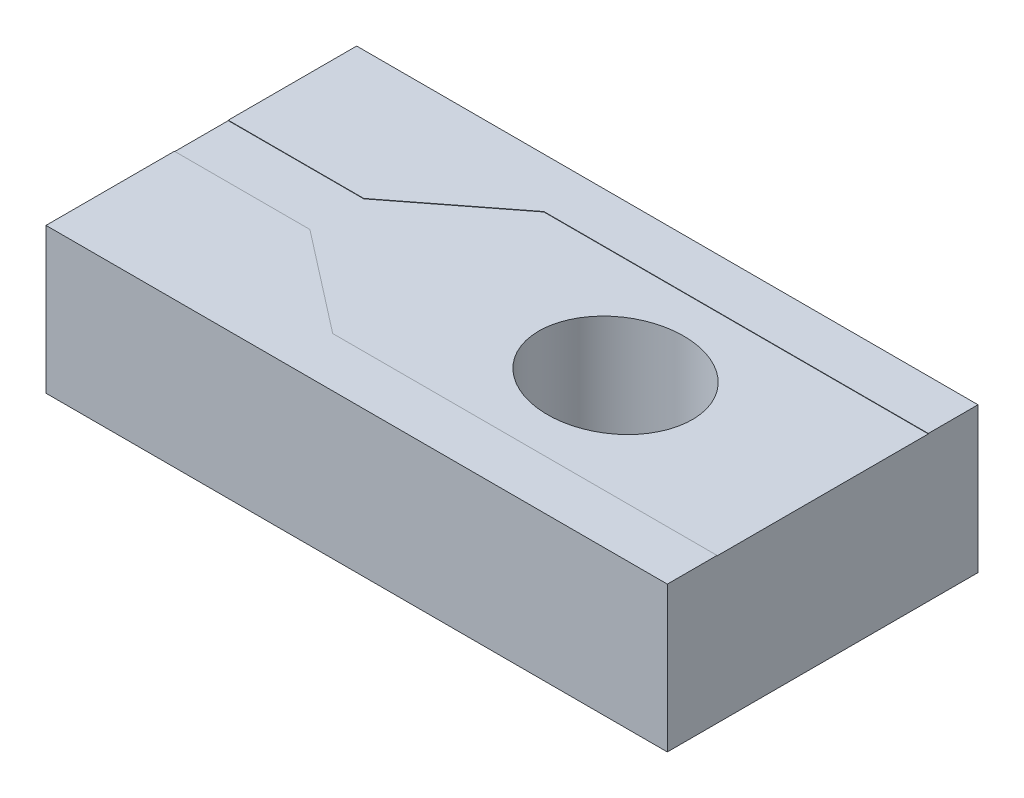
ISO-10303-21;
HEADER;
FILE_DESCRIPTION(('STEP AP214'),'2;1');
FILE_NAME('part.step','',(''),(''),'','','');
FILE_SCHEMA(('AUTOMOTIVE_DESIGN { 1 0 10303 214 1 1 1 1 }'));
ENDSEC;
DATA;
#1=APPLICATION_CONTEXT('core data for automotive mechanical design processes');
#2=APPLICATION_PROTOCOL_DEFINITION('international standard','automotive_design',2000,#1);
#3=PRODUCT_CONTEXT('',#1,'mechanical');
#4=PRODUCT('Part','Part','',(#3));
#5=PRODUCT_RELATED_PRODUCT_CATEGORY('part','',(#4));
#6=PRODUCT_DEFINITION_FORMATION('','',#4);
#7=PRODUCT_DEFINITION_CONTEXT('part definition',#1,'design');
#8=PRODUCT_DEFINITION('design','',#6,#7);
#9=PRODUCT_DEFINITION_SHAPE('','',#8);
#10=(LENGTH_UNIT() NAMED_UNIT(*) SI_UNIT(.MILLI.,.METRE.));
#11=(NAMED_UNIT(*) PLANE_ANGLE_UNIT() SI_UNIT($,.RADIAN.));
#12=(NAMED_UNIT(*) SI_UNIT($,.STERADIAN.) SOLID_ANGLE_UNIT());
#13=UNCERTAINTY_MEASURE_WITH_UNIT(LENGTH_MEASURE(1.E-05),#10,'distance_accuracy_value','');
#14=(GEOMETRIC_REPRESENTATION_CONTEXT(3) GLOBAL_UNCERTAINTY_ASSIGNED_CONTEXT((#13)) GLOBAL_UNIT_ASSIGNED_CONTEXT((#10,
#11,#12)) REPRESENTATION_CONTEXT('',''));
#15=CARTESIAN_POINT('',(0.,0.,0.));
#16=DIRECTION('',(0.,0.,1.));
#17=DIRECTION('',(1.,0.,0.));
#18=AXIS2_PLACEMENT_3D('',#15,#16,#17);
#19=CARTESIAN_POINT('',(0.,70.,0.));
#20=DIRECTION('',(0.,-1.,0.));
#21=DIRECTION('',(0.,0.,-1.));
#22=AXIS2_PLACEMENT_3D('',#19,#20,#21);
#23=PLANE('',#22);
#24=CARTESIAN_POINT('',(0.,70.,0.));
#25=DIRECTION('',(0.,1.,0.));
#26=DIRECTION('',(-1.,0.,0.));
#27=AXIS2_PLACEMENT_3D('',#24,#25,#26);
#28=ELLIPSE('',#27,37.075,32.9);
#29=CARTESIAN_POINT('',(-37.075,70.,0.));
#30=VERTEX_POINT('',#29);
#31=EDGE_CURVE('E194',#30,#30,#28,.T.);
#32=ORIENTED_EDGE('',*,*,#31,.F.);
#33=EDGE_LOOP('',(#32));
#34=FACE_BOUND('',#33,.T.);
#35=DIRECTION('',(-1.,0.,0.));
#36=VECTOR('',#35,1.);
#37=CARTESIAN_POINT('',(-85.575,70.,51.));
#38=LINE('',#37,#36);
#39=CARTESIAN_POINT('',(100.,70.,51.));
#40=VERTEX_POINT('',#39);
#41=CARTESIAN_POINT('',(-85.575,70.,51.));
#42=VERTEX_POINT('',#41);
#43=EDGE_CURVE('E177',#40,#42,#38,.T.);
#44=ORIENTED_EDGE('',*,*,#43,.F.);
#45=DIRECTION('',(0.,0.,-1.));
#46=VECTOR('',#45,1.);
#47=CARTESIAN_POINT('',(100.,70.,-75.));
#48=LINE('',#47,#46);
#49=CARTESIAN_POINT('',(100.,70.,-51.));
#50=VERTEX_POINT('',#49);
#51=EDGE_CURVE('E241',#40,#50,#48,.T.);
#52=ORIENTED_EDGE('',*,*,#51,.T.);
#53=DIRECTION('',(1.,0.,0.));
#54=VECTOR('',#53,1.);
#55=CARTESIAN_POINT('',(100.,70.,-51.));
#56=LINE('',#55,#54);
#57=CARTESIAN_POINT('',(-85.575,70.,-51.));
#58=VERTEX_POINT('',#57);
#59=EDGE_CURVE('E161',#58,#50,#56,.T.);
#60=ORIENTED_EDGE('',*,*,#59,.F.);
#61=DIRECTION('',(0.790219801194744,0.,-0.612823519293883));
#62=VECTOR('',#61,1.);
#63=CARTESIAN_POINT('',(-85.575,70.,-51.));
#64=LINE('',#63,#62);
#65=CARTESIAN_POINT('',(-134.575,70.,-13.));
#66=VERTEX_POINT('',#65);
#67=EDGE_CURVE('E176',#66,#58,#64,.T.);
#68=ORIENTED_EDGE('',*,*,#67,.F.);
#69=DIRECTION('',(1.,0.,0.));
#70=VECTOR('',#69,1.);
#71=CARTESIAN_POINT('',(-134.575,70.,-13.));
#72=LINE('',#71,#70);
#73=CARTESIAN_POINT('',(-200.,70.,-13.));
#74=VERTEX_POINT('',#73);
#75=EDGE_CURVE('E173',#74,#66,#72,.T.);
#76=ORIENTED_EDGE('',*,*,#75,.F.);
#77=DIRECTION('',(0.,0.,1.));
#78=VECTOR('',#77,1.);
#79=CARTESIAN_POINT('',(-200.,70.,-75.));
#80=LINE('',#79,#78);
#81=CARTESIAN_POINT('',(-200.,70.,13.));
#82=VERTEX_POINT('',#81);
#83=EDGE_CURVE('E248',#74,#82,#80,.T.);
#84=ORIENTED_EDGE('',*,*,#83,.T.);
#85=DIRECTION('',(-1.,0.,0.));
#86=VECTOR('',#85,1.);
#87=CARTESIAN_POINT('',(-200.,70.,13.));
#88=LINE('',#87,#86);
#89=CARTESIAN_POINT('',(-134.575,70.,13.));
#90=VERTEX_POINT('',#89);
#91=EDGE_CURVE('E60',#90,#82,#88,.T.);
#92=ORIENTED_EDGE('',*,*,#91,.F.);
#93=DIRECTION('',(-0.790219801194744,0.,-0.612823519293883));
#94=VECTOR('',#93,1.);
#95=CARTESIAN_POINT('',(-134.575,70.,13.));
#96=LINE('',#95,#94);
#97=EDGE_CURVE('E55',#42,#90,#96,.T.);
#98=ORIENTED_EDGE('',*,*,#97,.F.);
#99=EDGE_LOOP('',(#44,#52,#60,#68,#76,#84,#92,#98));
#100=FACE_BOUND('',#99,.T.);
#101=ADVANCED_FACE('F40',(#34,#100),#23,.F.);
#102=CARTESIAN_POINT('',(0.,0.,0.));
#103=DIRECTION('',(0.,-1.,0.));
#104=DIRECTION('',(0.,0.,-1.));
#105=AXIS2_PLACEMENT_3D('',#102,#103,#104);
#106=PLANE('',#105);
#107=DIRECTION('',(0.,0.,-1.));
#108=VECTOR('',#107,1.);
#109=CARTESIAN_POINT('',(100.,0.,-75.));
#110=LINE('',#109,#108);
#111=CARTESIAN_POINT('',(100.,0.,75.));
#112=VERTEX_POINT('',#111);
#113=CARTESIAN_POINT('',(100.,0.,-75.));
#114=VERTEX_POINT('',#113);
#115=EDGE_CURVE('E198',#112,#114,#110,.T.);
#116=ORIENTED_EDGE('',*,*,#115,.F.);
#117=DIRECTION('',(1.,0.,0.));
#118=VECTOR('',#117,1.);
#119=CARTESIAN_POINT('',(100.,0.,75.));
#120=LINE('',#119,#118);
#121=CARTESIAN_POINT('',(-200.,0.,75.));
#122=VERTEX_POINT('',#121);
#123=EDGE_CURVE('E239',#122,#112,#120,.T.);
#124=ORIENTED_EDGE('',*,*,#123,.F.);
#125=DIRECTION('',(0.,0.,1.));
#126=VECTOR('',#125,1.);
#127=CARTESIAN_POINT('',(-200.,0.,-75.));
#128=LINE('',#127,#126);
#129=CARTESIAN_POINT('',(-200.,0.,-75.));
#130=VERTEX_POINT('',#129);
#131=EDGE_CURVE('E233',#130,#122,#128,.T.);
#132=ORIENTED_EDGE('',*,*,#131,.F.);
#133=DIRECTION('',(-1.,0.,0.));
#134=VECTOR('',#133,1.);
#135=CARTESIAN_POINT('',(100.,0.,-75.));
#136=LINE('',#135,#134);
#137=EDGE_CURVE('E227',#114,#130,#136,.T.);
#138=ORIENTED_EDGE('',*,*,#137,.F.);
#139=EDGE_LOOP('',(#116,#124,#132,#138));
#140=FACE_BOUND('',#139,.T.);
#141=CARTESIAN_POINT('',(0.,0.,0.));
#142=DIRECTION('',(0.,1.,0.));
#143=DIRECTION('',(-1.,0.,0.));
#144=AXIS2_PLACEMENT_3D('',#141,#142,#143);
#145=ELLIPSE('',#144,37.075,32.9);
#146=CARTESIAN_POINT('',(-37.075,0.,0.));
#147=VERTEX_POINT('',#146);
#148=EDGE_CURVE('E193',#147,#147,#145,.T.);
#149=ORIENTED_EDGE('',*,*,#148,.T.);
#150=EDGE_LOOP('',(#149));
#151=FACE_BOUND('',#150,.T.);
#152=ADVANCED_FACE('F211',(#140,#151),#106,.T.);
#153=CARTESIAN_POINT('',(100.,70.,-75.));
#154=DIRECTION('',(-1.,0.,0.));
#155=DIRECTION('',(0.,0.,1.));
#156=AXIS2_PLACEMENT_3D('',#153,#154,#155);
#157=PLANE('',#156);
#158=ORIENTED_EDGE('',*,*,#115,.T.);
#159=DIRECTION('',(0.,-1.,0.));
#160=VECTOR('',#159,1.);
#161=CARTESIAN_POINT('',(100.,70.,-75.));
#162=LINE('',#161,#160);
#163=CARTESIAN_POINT('',(100.,70.2,-75.));
#164=VERTEX_POINT('',#163);
#165=EDGE_CURVE('E11',#164,#114,#162,.T.);
#166=ORIENTED_EDGE('',*,*,#165,.F.);
#167=DIRECTION('',(0.,0.,-1.));
#168=VECTOR('',#167,1.);
#169=CARTESIAN_POINT('',(100.,70.2,-51.));
#170=LINE('',#169,#168);
#171=CARTESIAN_POINT('',(100.,70.2,-51.));
#172=VERTEX_POINT('',#171);
#173=EDGE_CURVE('E157',#172,#164,#170,.T.);
#174=ORIENTED_EDGE('',*,*,#173,.F.);
#175=DIRECTION('',(0.,-1.,0.));
#176=VECTOR('',#175,1.);
#177=CARTESIAN_POINT('',(100.,70.2,-51.));
#178=LINE('',#177,#176);
#179=EDGE_CURVE('E172',#172,#50,#178,.T.);
#180=ORIENTED_EDGE('',*,*,#179,.T.);
#181=ORIENTED_EDGE('',*,*,#51,.F.);
#182=DIRECTION('',(0.,-1.,0.));
#183=VECTOR('',#182,1.);
#184=CARTESIAN_POINT('',(100.,70.2,51.));
#185=LINE('',#184,#183);
#186=CARTESIAN_POINT('',(100.,70.2,51.));
#187=VERTEX_POINT('',#186);
#188=EDGE_CURVE('E253',#187,#40,#185,.T.);
#189=ORIENTED_EDGE('',*,*,#188,.F.);
#190=DIRECTION('',(0.,0.,-1.));
#191=VECTOR('',#190,1.);
#192=CARTESIAN_POINT('',(100.,70.2,75.));
#193=LINE('',#192,#191);
#194=CARTESIAN_POINT('',(100.,70.2,75.));
#195=VERTEX_POINT('',#194);
#196=EDGE_CURVE('E153',#195,#187,#193,.T.);
#197=ORIENTED_EDGE('',*,*,#196,.F.);
#198=DIRECTION('',(0.,-1.,0.));
#199=VECTOR('',#198,1.);
#200=CARTESIAN_POINT('',(100.,70.,75.));
#201=LINE('',#200,#199);
#202=EDGE_CURVE('E245',#195,#112,#201,.T.);
#203=ORIENTED_EDGE('',*,*,#202,.T.);
#204=EDGE_LOOP('',(#158,#166,#174,#180,#181,#189,#197,#203));
#205=FACE_BOUND('',#204,.T.);
#206=ADVANCED_FACE('F42',(#205),#157,.F.);
#207=CARTESIAN_POINT('',(100.,70.,-75.));
#208=DIRECTION('',(0.,0.,1.));
#209=DIRECTION('',(1.,0.,0.));
#210=AXIS2_PLACEMENT_3D('',#207,#208,#209);
#211=PLANE('',#210);
#212=ORIENTED_EDGE('',*,*,#137,.T.);
#213=DIRECTION('',(0.,-1.,0.));
#214=VECTOR('',#213,1.);
#215=CARTESIAN_POINT('',(-200.,70.,-75.));
#216=LINE('',#215,#214);
#217=CARTESIAN_POINT('',(-200.,70.2,-75.));
#218=VERTEX_POINT('',#217);
#219=EDGE_CURVE('E48',#218,#130,#216,.T.);
#220=ORIENTED_EDGE('',*,*,#219,.F.);
#221=DIRECTION('',(-1.,0.,0.));
#222=VECTOR('',#221,1.);
#223=CARTESIAN_POINT('',(100.,70.2,-75.));
#224=LINE('',#223,#222);
#225=EDGE_CURVE('E160',#164,#218,#224,.T.);
#226=ORIENTED_EDGE('',*,*,#225,.F.);
#227=ORIENTED_EDGE('',*,*,#165,.T.);
#228=EDGE_LOOP('',(#212,#220,#226,#227));
#229=FACE_BOUND('',#228,.T.);
#230=ADVANCED_FACE('F220',(#229),#211,.F.);
#231=CARTESIAN_POINT('',(-200.,70.,-75.));
#232=DIRECTION('',(1.,0.,0.));
#233=DIRECTION('',(0.,0.,-1.));
#234=AXIS2_PLACEMENT_3D('',#231,#232,#233);
#235=PLANE('',#234);
#236=ORIENTED_EDGE('',*,*,#131,.T.);
#237=DIRECTION('',(0.,-1.,0.));
#238=VECTOR('',#237,1.);
#239=CARTESIAN_POINT('',(-200.,70.,75.));
#240=LINE('',#239,#238);
#241=CARTESIAN_POINT('',(-200.,70.2,75.));
#242=VERTEX_POINT('',#241);
#243=EDGE_CURVE('E148',#242,#122,#240,.T.);
#244=ORIENTED_EDGE('',*,*,#243,.F.);
#245=DIRECTION('',(0.,0.,1.));
#246=VECTOR('',#245,1.);
#247=CARTESIAN_POINT('',(-200.,70.2,13.));
#248=LINE('',#247,#246);
#249=CARTESIAN_POINT('',(-200.,70.2,13.));
#250=VERTEX_POINT('',#249);
#251=EDGE_CURVE('E132',#250,#242,#248,.T.);
#252=ORIENTED_EDGE('',*,*,#251,.F.);
#253=DIRECTION('',(0.,-1.,0.));
#254=VECTOR('',#253,1.);
#255=CARTESIAN_POINT('',(-200.,70.2,13.));
#256=LINE('',#255,#254);
#257=EDGE_CURVE('E138',#250,#82,#256,.T.);
#258=ORIENTED_EDGE('',*,*,#257,.T.);
#259=ORIENTED_EDGE('',*,*,#83,.F.);
#260=DIRECTION('',(0.,-1.,0.));
#261=VECTOR('',#260,1.);
#262=CARTESIAN_POINT('',(-200.,70.2,-13.));
#263=LINE('',#262,#261);
#264=CARTESIAN_POINT('',(-200.,70.2,-13.));
#265=VERTEX_POINT('',#264);
#266=EDGE_CURVE('E190',#265,#74,#263,.T.);
#267=ORIENTED_EDGE('',*,*,#266,.F.);
#268=DIRECTION('',(0.,0.,1.));
#269=VECTOR('',#268,1.);
#270=CARTESIAN_POINT('',(-200.,70.2,-75.));
#271=LINE('',#270,#269);
#272=EDGE_CURVE('E164',#218,#265,#271,.T.);
#273=ORIENTED_EDGE('',*,*,#272,.F.);
#274=ORIENTED_EDGE('',*,*,#219,.T.);
#275=EDGE_LOOP('',(#236,#244,#252,#258,#259,#267,#273,#274));
#276=FACE_BOUND('',#275,.T.);
#277=ADVANCED_FACE('F146',(#276),#235,.F.);
#278=CARTESIAN_POINT('',(100.,70.,75.));
#279=DIRECTION('',(0.,0.,-1.));
#280=DIRECTION('',(-1.,0.,0.));
#281=AXIS2_PLACEMENT_3D('',#278,#279,#280);
#282=PLANE('',#281);
#283=ORIENTED_EDGE('',*,*,#123,.T.);
#284=ORIENTED_EDGE('',*,*,#202,.F.);
#285=DIRECTION('',(1.,0.,0.));
#286=VECTOR('',#285,1.);
#287=CARTESIAN_POINT('',(-200.,70.2,75.));
#288=LINE('',#287,#286);
#289=EDGE_CURVE('E150',#242,#195,#288,.T.);
#290=ORIENTED_EDGE('',*,*,#289,.F.);
#291=ORIENTED_EDGE('',*,*,#243,.T.);
#292=EDGE_LOOP('',(#283,#284,#290,#291));
#293=FACE_BOUND('',#292,.T.);
#294=ADVANCED_FACE('F206',(#293),#282,.F.);
#295=DIRECTION('',(0.,-1.,0.));
#296=VECTOR('',#295,1.);
#297=SURFACE_OF_LINEAR_EXTRUSION('',#28,#296);
#298=ORIENTED_EDGE('',*,*,#31,.T.);
#299=EDGE_LOOP('',(#298));
#300=FACE_BOUND('',#299,.T.);
#301=ORIENTED_EDGE('',*,*,#148,.F.);
#302=EDGE_LOOP('',(#301));
#303=FACE_BOUND('',#302,.T.);
#304=ADVANCED_FACE('F201',(#300,#303),#297,.T.);
#305=CARTESIAN_POINT('',(-134.575,70.2,-13.));
#306=DIRECTION('',(0.,0.,-1.));
#307=DIRECTION('',(-1.,0.,0.));
#308=AXIS2_PLACEMENT_3D('',#305,#306,#307);
#309=PLANE('',#308);
#310=ORIENTED_EDGE('',*,*,#75,.T.);
#311=DIRECTION('',(0.,-1.,0.));
#312=VECTOR('',#311,1.);
#313=CARTESIAN_POINT('',(-134.575,70.2,-13.));
#314=LINE('',#313,#312);
#315=CARTESIAN_POINT('',(-134.575,70.2,-13.));
#316=VERTEX_POINT('',#315);
#317=EDGE_CURVE('E187',#316,#66,#314,.T.);
#318=ORIENTED_EDGE('',*,*,#317,.F.);
#319=DIRECTION('',(1.,0.,0.));
#320=VECTOR('',#319,1.);
#321=CARTESIAN_POINT('',(-134.575,70.2,-13.));
#322=LINE('',#321,#320);
#323=EDGE_CURVE('E166',#265,#316,#322,.T.);
#324=ORIENTED_EDGE('',*,*,#323,.F.);
#325=ORIENTED_EDGE('',*,*,#266,.T.);
#326=EDGE_LOOP('',(#310,#318,#324,#325));
#327=FACE_BOUND('',#326,.T.);
#328=ADVANCED_FACE('F205',(#327),#309,.F.);
#329=CARTESIAN_POINT('',(-85.575,70.2,-51.));
#330=DIRECTION('',(-0.612823519293883,0.,-0.790219801194744));
#331=DIRECTION('',(-0.790219801194744,0.,0.612823519293883));
#332=AXIS2_PLACEMENT_3D('',#329,#330,#331);
#333=PLANE('',#332);
#334=ORIENTED_EDGE('',*,*,#67,.T.);
#335=DIRECTION('',(0.,-1.,0.));
#336=VECTOR('',#335,1.);
#337=CARTESIAN_POINT('',(-85.575,70.2,-51.));
#338=LINE('',#337,#336);
#339=CARTESIAN_POINT('',(-85.575,70.2,-51.));
#340=VERTEX_POINT('',#339);
#341=EDGE_CURVE('E184',#340,#58,#338,.T.);
#342=ORIENTED_EDGE('',*,*,#341,.F.);
#343=DIRECTION('',(0.790219801194744,0.,-0.612823519293883));
#344=VECTOR('',#343,1.);
#345=CARTESIAN_POINT('',(-85.575,70.2,-51.));
#346=LINE('',#345,#344);
#347=EDGE_CURVE('E168',#316,#340,#346,.T.);
#348=ORIENTED_EDGE('',*,*,#347,.F.);
#349=ORIENTED_EDGE('',*,*,#317,.T.);
#350=EDGE_LOOP('',(#334,#342,#348,#349));
#351=FACE_BOUND('',#350,.T.);
#352=ADVANCED_FACE('F287',(#351),#333,.F.);
#353=CARTESIAN_POINT('',(100.,70.2,-51.));
#354=DIRECTION('',(0.,0.,-1.));
#355=DIRECTION('',(-1.,0.,0.));
#356=AXIS2_PLACEMENT_3D('',#353,#354,#355);
#357=PLANE('',#356);
#358=ORIENTED_EDGE('',*,*,#59,.T.);
#359=ORIENTED_EDGE('',*,*,#179,.F.);
#360=DIRECTION('',(1.,0.,0.));
#361=VECTOR('',#360,1.);
#362=CARTESIAN_POINT('',(100.,70.2,-51.));
#363=LINE('',#362,#361);
#364=EDGE_CURVE('E170',#340,#172,#363,.T.);
#365=ORIENTED_EDGE('',*,*,#364,.F.);
#366=ORIENTED_EDGE('',*,*,#341,.T.);
#367=EDGE_LOOP('',(#358,#359,#365,#366));
#368=FACE_BOUND('',#367,.T.);
#369=ADVANCED_FACE('F284',(#368),#357,.F.);
#370=CARTESIAN_POINT('',(0.,70.2,0.));
#371=DIRECTION('',(0.,1.,0.));
#372=DIRECTION('',(0.,0.,1.));
#373=AXIS2_PLACEMENT_3D('',#370,#371,#372);
#374=PLANE('',#373);
#375=ORIENTED_EDGE('',*,*,#173,.T.);
#376=ORIENTED_EDGE('',*,*,#225,.T.);
#377=ORIENTED_EDGE('',*,*,#272,.T.);
#378=ORIENTED_EDGE('',*,*,#323,.T.);
#379=ORIENTED_EDGE('',*,*,#347,.T.);
#380=ORIENTED_EDGE('',*,*,#364,.T.);
#381=EDGE_LOOP('',(#375,#376,#377,#378,#379,#380));
#382=FACE_BOUND('',#381,.T.);
#383=ADVANCED_FACE('F277',(#382),#374,.T.);
#384=CARTESIAN_POINT('',(-85.575,70.2,51.));
#385=DIRECTION('',(0.,0.,1.));
#386=DIRECTION('',(1.,0.,0.));
#387=AXIS2_PLACEMENT_3D('',#384,#385,#386);
#388=PLANE('',#387);
#389=ORIENTED_EDGE('',*,*,#43,.T.);
#390=DIRECTION('',(0.,-1.,0.));
#391=VECTOR('',#390,1.);
#392=CARTESIAN_POINT('',(-85.575,70.2,51.));
#393=LINE('',#392,#391);
#394=CARTESIAN_POINT('',(-85.575,70.2,51.));
#395=VERTEX_POINT('',#394);
#396=EDGE_CURVE('E262',#395,#42,#393,.T.);
#397=ORIENTED_EDGE('',*,*,#396,.F.);
#398=DIRECTION('',(-1.,0.,0.));
#399=VECTOR('',#398,1.);
#400=CARTESIAN_POINT('',(-85.575,70.2,51.));
#401=LINE('',#400,#399);
#402=EDGE_CURVE('E255',#187,#395,#401,.T.);
#403=ORIENTED_EDGE('',*,*,#402,.F.);
#404=ORIENTED_EDGE('',*,*,#188,.T.);
#405=EDGE_LOOP('',(#389,#397,#403,#404));
#406=FACE_BOUND('',#405,.T.);
#407=ADVANCED_FACE('F266',(#406),#388,.F.);
#408=CARTESIAN_POINT('',(-134.575,70.2,13.));
#409=DIRECTION('',(-0.612823519293883,0.,0.790219801194744));
#410=DIRECTION('',(0.790219801194744,0.,0.612823519293883));
#411=AXIS2_PLACEMENT_3D('',#408,#409,#410);
#412=PLANE('',#411);
#413=ORIENTED_EDGE('',*,*,#97,.T.);
#414=DIRECTION('',(0.,-1.,0.));
#415=VECTOR('',#414,1.);
#416=CARTESIAN_POINT('',(-134.575,70.2,13.));
#417=LINE('',#416,#415);
#418=CARTESIAN_POINT('',(-134.575,70.2,13.));
#419=VERTEX_POINT('',#418);
#420=EDGE_CURVE('E144',#419,#90,#417,.T.);
#421=ORIENTED_EDGE('',*,*,#420,.F.);
#422=DIRECTION('',(-0.790219801194744,0.,-0.612823519293883));
#423=VECTOR('',#422,1.);
#424=CARTESIAN_POINT('',(-134.575,70.2,13.));
#425=LINE('',#424,#423);
#426=EDGE_CURVE('E134',#395,#419,#425,.T.);
#427=ORIENTED_EDGE('',*,*,#426,.F.);
#428=ORIENTED_EDGE('',*,*,#396,.T.);
#429=EDGE_LOOP('',(#413,#421,#427,#428));
#430=FACE_BOUND('',#429,.T.);
#431=ADVANCED_FACE('F269',(#430),#412,.F.);
#432=CARTESIAN_POINT('',(-200.,70.2,13.));
#433=DIRECTION('',(0.,0.,1.));
#434=DIRECTION('',(1.,0.,0.));
#435=AXIS2_PLACEMENT_3D('',#432,#433,#434);
#436=PLANE('',#435);
#437=ORIENTED_EDGE('',*,*,#91,.T.);
#438=ORIENTED_EDGE('',*,*,#257,.F.);
#439=DIRECTION('',(-1.,0.,0.));
#440=VECTOR('',#439,1.);
#441=CARTESIAN_POINT('',(-200.,70.2,13.));
#442=LINE('',#441,#440);
#443=EDGE_CURVE('E127',#419,#250,#442,.T.);
#444=ORIENTED_EDGE('',*,*,#443,.F.);
#445=ORIENTED_EDGE('',*,*,#420,.T.);
#446=EDGE_LOOP('',(#437,#438,#444,#445));
#447=FACE_BOUND('',#446,.T.);
#448=ADVANCED_FACE('F141',(#447),#436,.F.);
#449=CARTESIAN_POINT('',(0.,70.2,0.));
#450=DIRECTION('',(0.,1.,0.));
#451=DIRECTION('',(0.,0.,1.));
#452=AXIS2_PLACEMENT_3D('',#449,#450,#451);
#453=PLANE('',#452);
#454=ORIENTED_EDGE('',*,*,#251,.T.);
#455=ORIENTED_EDGE('',*,*,#289,.T.);
#456=ORIENTED_EDGE('',*,*,#196,.T.);
#457=ORIENTED_EDGE('',*,*,#402,.T.);
#458=ORIENTED_EDGE('',*,*,#426,.T.);
#459=ORIENTED_EDGE('',*,*,#443,.T.);
#460=EDGE_LOOP('',(#454,#455,#456,#457,#458,#459));
#461=FACE_BOUND('',#460,.T.);
#462=ADVANCED_FACE('F129',(#461),#453,.T.);
#463=CLOSED_SHELL('',(#101,#152,#206,#230,#277,#294,#304,#328,#352,#369,#383,#407,#431,#448,#462));
#464=MANIFOLD_SOLID_BREP('B2',#463);
#465=ADVANCED_BREP_SHAPE_REPRESENTATION('',(#18,#464),#14);
#466=SHAPE_DEFINITION_REPRESENTATION(#9,#465);
ENDSEC;
END-ISO-10303-21;
